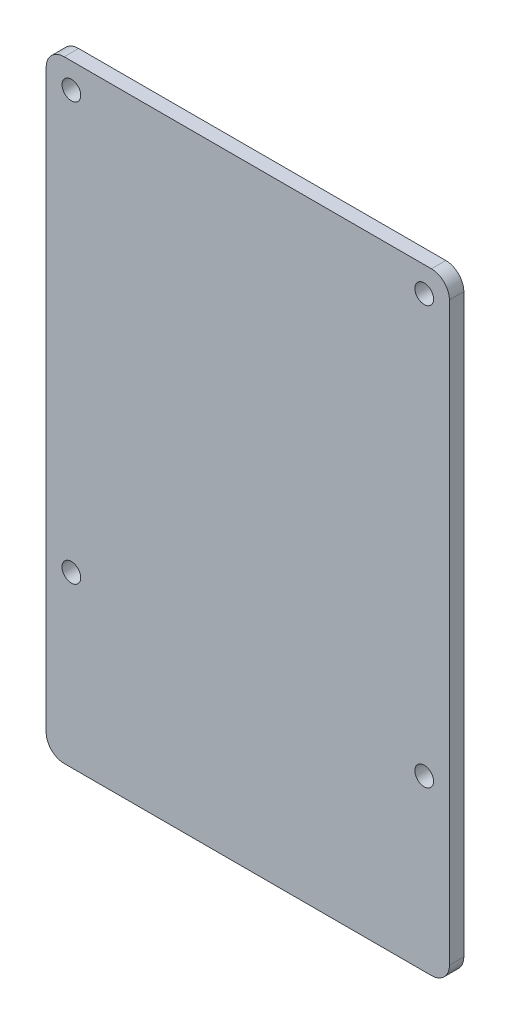
ISO-10303-21;
HEADER;
FILE_DESCRIPTION(('STEP AP214'),'2;1');
FILE_NAME('part.step','',(''),(''),'','','');
FILE_SCHEMA(('AUTOMOTIVE_DESIGN { 1 0 10303 214 1 1 1 1 }'));
ENDSEC;
DATA;
#1=APPLICATION_CONTEXT('core data for automotive mechanical design processes');
#2=APPLICATION_PROTOCOL_DEFINITION('international standard','automotive_design',2000,#1);
#3=PRODUCT_CONTEXT('',#1,'mechanical');
#4=PRODUCT('Part','Part','',(#3));
#5=PRODUCT_RELATED_PRODUCT_CATEGORY('part','',(#4));
#6=PRODUCT_DEFINITION_FORMATION('','',#4);
#7=PRODUCT_DEFINITION_CONTEXT('part definition',#1,'design');
#8=PRODUCT_DEFINITION('design','',#6,#7);
#9=PRODUCT_DEFINITION_SHAPE('','',#8);
#10=(LENGTH_UNIT() NAMED_UNIT(*) SI_UNIT(.MILLI.,.METRE.));
#11=(NAMED_UNIT(*) PLANE_ANGLE_UNIT() SI_UNIT($,.RADIAN.));
#12=(NAMED_UNIT(*) SI_UNIT($,.STERADIAN.) SOLID_ANGLE_UNIT());
#13=UNCERTAINTY_MEASURE_WITH_UNIT(LENGTH_MEASURE(1.E-05),#10,'distance_accuracy_value','');
#14=(GEOMETRIC_REPRESENTATION_CONTEXT(3) GLOBAL_UNCERTAINTY_ASSIGNED_CONTEXT((#13)) GLOBAL_UNIT_ASSIGNED_CONTEXT((#10,
#11,#12)) REPRESENTATION_CONTEXT('',''));
#15=CARTESIAN_POINT('',(0.,0.,0.));
#16=DIRECTION('',(0.,0.,1.));
#17=DIRECTION('',(1.,0.,0.));
#18=AXIS2_PLACEMENT_3D('',#15,#16,#17);
#19=CARTESIAN_POINT('',(-1.00000000002509,-78.9999999999772,2.));
#20=DIRECTION('',(0.,0.,1.));
#21=DIRECTION('',(1.,0.,0.));
#22=AXIS2_PLACEMENT_3D('',#19,#20,#21);
#23=PLANE('',#22);
#24=CARTESIAN_POINT('',(-5.04596364692134E-11,-57.9999999999998,2.));
#25=DIRECTION('',(0.,0.,1.));
#26=DIRECTION('',(-1.,0.,0.));
#27=AXIS2_PLACEMENT_3D('',#24,#25,#26);
#28=CIRCLE('',#27,1.29999999995987);
#29=CARTESIAN_POINT('',(-1.30000000001033,-57.9999999999998,2.));
#30=VERTEX_POINT('',#29);
#31=EDGE_CURVE('E192',#30,#30,#28,.T.);
#32=ORIENTED_EDGE('',*,*,#31,.F.);
#33=EDGE_LOOP('',(#32));
#34=FACE_BOUND('',#33,.T.);
#35=CARTESIAN_POINT('',(49.0000000000003,-57.9999999999997,2.));
#36=DIRECTION('',(0.,0.,1.));
#37=DIRECTION('',(1.,0.,0.));
#38=AXIS2_PLACEMENT_3D('',#35,#36,#37);
#39=CIRCLE('',#38,1.3);
#40=CARTESIAN_POINT('',(50.3000000000003,-57.9999999999997,2.));
#41=VERTEX_POINT('',#40);
#42=EDGE_CURVE('E138',#41,#41,#39,.T.);
#43=ORIENTED_EDGE('',*,*,#42,.F.);
#44=EDGE_LOOP('',(#43));
#45=FACE_BOUND('',#44,.T.);
#46=CARTESIAN_POINT('',(-1.00000000002509,-78.9999999999772,2.));
#47=DIRECTION('',(0.,0.,1.));
#48=DIRECTION('',(1.,0.,0.));
#49=AXIS2_PLACEMENT_3D('',#46,#47,#48);
#50=CIRCLE('',#49,2.5);
#51=CARTESIAN_POINT('',(-3.50000000002509,-78.9999999999772,2.));
#52=VERTEX_POINT('',#51);
#53=CARTESIAN_POINT('',(-1.00000000002509,-81.4999999999772,2.));
#54=VERTEX_POINT('',#53);
#55=EDGE_CURVE('E149',#52,#54,#50,.T.);
#56=ORIENTED_EDGE('',*,*,#55,.T.);
#57=DIRECTION('',(1.,0.,0.));
#58=VECTOR('',#57,1.);
#59=CARTESIAN_POINT('',(-1.00000000002509,-81.4999999999772,2.));
#60=LINE('',#59,#58);
#61=CARTESIAN_POINT('',(49.9999999999749,-81.4999999999772,2.));
#62=VERTEX_POINT('',#61);
#63=EDGE_CURVE('E97',#54,#62,#60,.T.);
#64=ORIENTED_EDGE('',*,*,#63,.T.);
#65=CARTESIAN_POINT('',(49.9999999999749,-78.9999999999772,2.));
#66=DIRECTION('',(0.,0.,1.));
#67=DIRECTION('',(1.,0.,0.));
#68=AXIS2_PLACEMENT_3D('',#65,#66,#67);
#69=CIRCLE('',#68,2.5);
#70=CARTESIAN_POINT('',(52.4999999999749,-78.9999999999772,2.));
#71=VERTEX_POINT('',#70);
#72=EDGE_CURVE('E164',#62,#71,#69,.T.);
#73=ORIENTED_EDGE('',*,*,#72,.T.);
#74=DIRECTION('',(0.,1.,0.));
#75=VECTOR('',#74,1.);
#76=CARTESIAN_POINT('',(52.4999999999749,1.00000000002282,2.));
#77=LINE('',#76,#75);
#78=CARTESIAN_POINT('',(52.4999999999749,1.00000000002282,2.));
#79=VERTEX_POINT('',#78);
#80=EDGE_CURVE('E177',#71,#79,#77,.T.);
#81=ORIENTED_EDGE('',*,*,#80,.T.);
#82=CARTESIAN_POINT('',(49.9999999999749,1.00000000002282,2.));
#83=DIRECTION('',(0.,0.,1.));
#84=DIRECTION('',(-1.,0.,0.));
#85=AXIS2_PLACEMENT_3D('',#82,#83,#84);
#86=CIRCLE('',#85,2.5);
#87=CARTESIAN_POINT('',(49.9999999999749,3.50000000002282,2.));
#88=VERTEX_POINT('',#87);
#89=EDGE_CURVE('E116',#79,#88,#86,.T.);
#90=ORIENTED_EDGE('',*,*,#89,.T.);
#91=DIRECTION('',(-1.,0.,0.));
#92=VECTOR('',#91,1.);
#93=CARTESIAN_POINT('',(-1.0000000000251,3.50000000002281,2.));
#94=LINE('',#93,#92);
#95=CARTESIAN_POINT('',(-1.0000000000251,3.50000000002281,2.));
#96=VERTEX_POINT('',#95);
#97=EDGE_CURVE('E110',#88,#96,#94,.T.);
#98=ORIENTED_EDGE('',*,*,#97,.T.);
#99=CARTESIAN_POINT('',(-1.0000000000251,1.00000000002281,2.));
#100=DIRECTION('',(0.,0.,1.));
#101=DIRECTION('',(1.,0.,0.));
#102=AXIS2_PLACEMENT_3D('',#99,#100,#101);
#103=CIRCLE('',#102,2.5);
#104=CARTESIAN_POINT('',(-3.5000000000251,1.00000000002281,2.));
#105=VERTEX_POINT('',#104);
#106=EDGE_CURVE('E114',#96,#105,#103,.T.);
#107=ORIENTED_EDGE('',*,*,#106,.T.);
#108=DIRECTION('',(0.,-1.,0.));
#109=VECTOR('',#108,1.);
#110=CARTESIAN_POINT('',(-3.5000000000251,1.00000000002281,2.));
#111=LINE('',#110,#109);
#112=EDGE_CURVE('E54',#105,#52,#111,.T.);
#113=ORIENTED_EDGE('',*,*,#112,.T.);
#114=EDGE_LOOP('',(#56,#64,#73,#81,#90,#98,#107,#113));
#115=FACE_BOUND('',#114,.T.);
#116=CARTESIAN_POINT('',(48.9999999999498,3.66304209187263E-11,2.));
#117=DIRECTION('',(0.,0.,1.));
#118=DIRECTION('',(1.,0.,0.));
#119=AXIS2_PLACEMENT_3D('',#116,#117,#118);
#120=CIRCLE('',#119,1.30000000002938);
#121=CARTESIAN_POINT('',(50.2999999999792,3.66304209187263E-11,2.));
#122=VERTEX_POINT('',#121);
#123=EDGE_CURVE('E186',#122,#122,#120,.T.);
#124=ORIENTED_EDGE('',*,*,#123,.F.);
#125=EDGE_LOOP('',(#124));
#126=FACE_BOUND('',#125,.T.);
#127=CARTESIAN_POINT('',(0.,0.,2.));
#128=DIRECTION('',(0.,0.,1.));
#129=DIRECTION('',(-1.,0.,0.));
#130=AXIS2_PLACEMENT_3D('',#127,#128,#129);
#131=CIRCLE('',#130,1.29999999999994);
#132=CARTESIAN_POINT('',(-1.29999999999994,0.,2.));
#133=VERTEX_POINT('',#132);
#134=EDGE_CURVE('E198',#133,#133,#131,.T.);
#135=ORIENTED_EDGE('',*,*,#134,.F.);
#136=EDGE_LOOP('',(#135));
#137=FACE_BOUND('',#136,.T.);
#138=ADVANCED_FACE('F37',(#34,#45,#115,#126,#137),#23,.T.);
#139=CARTESIAN_POINT('',(-1.00000000002509,-78.9999999999772,0.));
#140=DIRECTION('',(0.,0.,1.));
#141=DIRECTION('',(1.,0.,0.));
#142=AXIS2_PLACEMENT_3D('',#139,#140,#141);
#143=PLANE('',#142);
#144=CARTESIAN_POINT('',(-1.00000000002509,-78.9999999999772,0.));
#145=DIRECTION('',(0.,0.,1.));
#146=DIRECTION('',(1.,0.,0.));
#147=AXIS2_PLACEMENT_3D('',#144,#145,#146);
#148=CIRCLE('',#147,2.5);
#149=CARTESIAN_POINT('',(-3.50000000002509,-78.9999999999772,0.));
#150=VERTEX_POINT('',#149);
#151=CARTESIAN_POINT('',(-1.00000000002509,-81.4999999999772,0.));
#152=VERTEX_POINT('',#151);
#153=EDGE_CURVE('E134',#150,#152,#148,.T.);
#154=ORIENTED_EDGE('',*,*,#153,.F.);
#155=DIRECTION('',(0.,-1.,0.));
#156=VECTOR('',#155,1.);
#157=CARTESIAN_POINT('',(-3.5000000000251,1.00000000002281,0.));
#158=LINE('',#157,#156);
#159=CARTESIAN_POINT('',(-3.5000000000251,1.00000000002281,0.));
#160=VERTEX_POINT('',#159);
#161=EDGE_CURVE('E89',#160,#150,#158,.T.);
#162=ORIENTED_EDGE('',*,*,#161,.F.);
#163=CARTESIAN_POINT('',(-1.0000000000251,1.00000000002281,0.));
#164=DIRECTION('',(0.,0.,1.));
#165=DIRECTION('',(1.,0.,0.));
#166=AXIS2_PLACEMENT_3D('',#163,#164,#165);
#167=CIRCLE('',#166,2.5);
#168=CARTESIAN_POINT('',(-1.0000000000251,3.50000000002281,0.));
#169=VERTEX_POINT('',#168);
#170=EDGE_CURVE('E83',#169,#160,#167,.T.);
#171=ORIENTED_EDGE('',*,*,#170,.F.);
#172=DIRECTION('',(-1.,0.,0.));
#173=VECTOR('',#172,1.);
#174=CARTESIAN_POINT('',(-1.0000000000251,3.50000000002281,0.));
#175=LINE('',#174,#173);
#176=CARTESIAN_POINT('',(49.9999999999749,3.50000000002282,0.));
#177=VERTEX_POINT('',#176);
#178=EDGE_CURVE('E124',#177,#169,#175,.T.);
#179=ORIENTED_EDGE('',*,*,#178,.F.);
#180=CARTESIAN_POINT('',(49.9999999999749,1.00000000002282,0.));
#181=DIRECTION('',(0.,0.,1.));
#182=DIRECTION('',(-1.,0.,0.));
#183=AXIS2_PLACEMENT_3D('',#180,#181,#182);
#184=CIRCLE('',#183,2.5);
#185=CARTESIAN_POINT('',(52.4999999999749,1.00000000002282,0.));
#186=VERTEX_POINT('',#185);
#187=EDGE_CURVE('E144',#186,#177,#184,.T.);
#188=ORIENTED_EDGE('',*,*,#187,.F.);
#189=DIRECTION('',(0.,1.,0.));
#190=VECTOR('',#189,1.);
#191=CARTESIAN_POINT('',(52.4999999999749,1.00000000002282,0.));
#192=LINE('',#191,#190);
#193=CARTESIAN_POINT('',(52.4999999999749,-78.9999999999772,0.));
#194=VERTEX_POINT('',#193);
#195=EDGE_CURVE('E142',#194,#186,#192,.T.);
#196=ORIENTED_EDGE('',*,*,#195,.F.);
#197=CARTESIAN_POINT('',(49.9999999999749,-78.9999999999772,0.));
#198=DIRECTION('',(0.,0.,1.));
#199=DIRECTION('',(1.,0.,0.));
#200=AXIS2_PLACEMENT_3D('',#197,#198,#199);
#201=CIRCLE('',#200,2.5);
#202=CARTESIAN_POINT('',(49.9999999999749,-81.4999999999772,0.));
#203=VERTEX_POINT('',#202);
#204=EDGE_CURVE('E140',#203,#194,#201,.T.);
#205=ORIENTED_EDGE('',*,*,#204,.F.);
#206=DIRECTION('',(1.,0.,0.));
#207=VECTOR('',#206,1.);
#208=CARTESIAN_POINT('',(-1.00000000002509,-81.4999999999772,0.));
#209=LINE('',#208,#207);
#210=EDGE_CURVE('E137',#152,#203,#209,.T.);
#211=ORIENTED_EDGE('',*,*,#210,.F.);
#212=EDGE_LOOP('',(#154,#162,#171,#179,#188,#196,#205,#211));
#213=FACE_BOUND('',#212,.T.);
#214=CARTESIAN_POINT('',(49.0000000000003,-57.9999999999997,0.));
#215=DIRECTION('',(0.,0.,1.));
#216=DIRECTION('',(1.,0.,0.));
#217=AXIS2_PLACEMENT_3D('',#214,#215,#216);
#218=CIRCLE('',#217,1.3);
#219=CARTESIAN_POINT('',(50.3000000000003,-57.9999999999997,0.));
#220=VERTEX_POINT('',#219);
#221=EDGE_CURVE('E183',#220,#220,#218,.T.);
#222=ORIENTED_EDGE('',*,*,#221,.T.);
#223=EDGE_LOOP('',(#222));
#224=FACE_BOUND('',#223,.T.);
#225=CARTESIAN_POINT('',(48.9999999999498,3.66304209187263E-11,0.));
#226=DIRECTION('',(0.,0.,1.));
#227=DIRECTION('',(1.,0.,0.));
#228=AXIS2_PLACEMENT_3D('',#225,#226,#227);
#229=CIRCLE('',#228,1.30000000002938);
#230=CARTESIAN_POINT('',(50.2999999999792,3.66304209187263E-11,0.));
#231=VERTEX_POINT('',#230);
#232=EDGE_CURVE('E189',#231,#231,#229,.T.);
#233=ORIENTED_EDGE('',*,*,#232,.T.);
#234=EDGE_LOOP('',(#233));
#235=FACE_BOUND('',#234,.T.);
#236=CARTESIAN_POINT('',(-5.04596364692134E-11,-57.9999999999998,0.));
#237=DIRECTION('',(0.,0.,1.));
#238=DIRECTION('',(-1.,0.,0.));
#239=AXIS2_PLACEMENT_3D('',#236,#237,#238);
#240=CIRCLE('',#239,1.29999999995987);
#241=CARTESIAN_POINT('',(-1.30000000001033,-57.9999999999998,0.));
#242=VERTEX_POINT('',#241);
#243=EDGE_CURVE('E195',#242,#242,#240,.T.);
#244=ORIENTED_EDGE('',*,*,#243,.T.);
#245=EDGE_LOOP('',(#244));
#246=FACE_BOUND('',#245,.T.);
#247=CARTESIAN_POINT('',(0.,0.,0.));
#248=DIRECTION('',(0.,0.,1.));
#249=DIRECTION('',(-1.,0.,0.));
#250=AXIS2_PLACEMENT_3D('',#247,#248,#249);
#251=CIRCLE('',#250,1.29999999999994);
#252=CARTESIAN_POINT('',(-1.29999999999994,0.,0.));
#253=VERTEX_POINT('',#252);
#254=EDGE_CURVE('E201',#253,#253,#251,.T.);
#255=ORIENTED_EDGE('',*,*,#254,.T.);
#256=EDGE_LOOP('',(#255));
#257=FACE_BOUND('',#256,.T.);
#258=ADVANCED_FACE('F168',(#213,#224,#235,#246,#257),#143,.F.);
#259=CARTESIAN_POINT('',(-1.00000000002509,-78.9999999999772,2.));
#260=DIRECTION('',(0.,0.,-1.));
#261=DIRECTION('',(-1.,0.,0.));
#262=AXIS2_PLACEMENT_3D('',#259,#260,#261);
#263=CYLINDRICAL_SURFACE('',#262,2.5);
#264=ORIENTED_EDGE('',*,*,#153,.T.);
#265=DIRECTION('',(0.,0.,-1.));
#266=VECTOR('',#265,1.);
#267=CARTESIAN_POINT('',(-1.00000000002509,-81.4999999999772,2.));
#268=LINE('',#267,#266);
#269=EDGE_CURVE('E11',#54,#152,#268,.T.);
#270=ORIENTED_EDGE('',*,*,#269,.F.);
#271=ORIENTED_EDGE('',*,*,#55,.F.);
#272=DIRECTION('',(0.,0.,-1.));
#273=VECTOR('',#272,1.);
#274=CARTESIAN_POINT('',(-3.50000000002509,-78.9999999999772,2.));
#275=LINE('',#274,#273);
#276=EDGE_CURVE('E130',#52,#150,#275,.T.);
#277=ORIENTED_EDGE('',*,*,#276,.T.);
#278=EDGE_LOOP('',(#264,#270,#271,#277));
#279=FACE_BOUND('',#278,.T.);
#280=ADVANCED_FACE('F39',(#279),#263,.T.);
#281=CARTESIAN_POINT('',(-1.00000000002509,-81.4999999999772,2.));
#282=DIRECTION('',(0.,1.,0.));
#283=DIRECTION('',(0.,0.,1.));
#284=AXIS2_PLACEMENT_3D('',#281,#282,#283);
#285=PLANE('',#284);
#286=ORIENTED_EDGE('',*,*,#210,.T.);
#287=DIRECTION('',(0.,0.,-1.));
#288=VECTOR('',#287,1.);
#289=CARTESIAN_POINT('',(49.9999999999749,-81.4999999999772,2.));
#290=LINE('',#289,#288);
#291=EDGE_CURVE('E46',#62,#203,#290,.T.);
#292=ORIENTED_EDGE('',*,*,#291,.F.);
#293=ORIENTED_EDGE('',*,*,#63,.F.);
#294=ORIENTED_EDGE('',*,*,#269,.T.);
#295=EDGE_LOOP('',(#286,#292,#293,#294));
#296=FACE_BOUND('',#295,.T.);
#297=ADVANCED_FACE('F235',(#296),#285,.F.);
#298=CARTESIAN_POINT('',(49.9999999999749,-78.9999999999772,2.));
#299=DIRECTION('',(0.,0.,-1.));
#300=DIRECTION('',(-1.,0.,0.));
#301=AXIS2_PLACEMENT_3D('',#298,#299,#300);
#302=CYLINDRICAL_SURFACE('',#301,2.5);
#303=ORIENTED_EDGE('',*,*,#204,.T.);
#304=DIRECTION('',(0.,0.,-1.));
#305=VECTOR('',#304,1.);
#306=CARTESIAN_POINT('',(52.4999999999749,-78.9999999999772,2.));
#307=LINE('',#306,#305);
#308=EDGE_CURVE('E156',#71,#194,#307,.T.);
#309=ORIENTED_EDGE('',*,*,#308,.F.);
#310=ORIENTED_EDGE('',*,*,#72,.F.);
#311=ORIENTED_EDGE('',*,*,#291,.T.);
#312=EDGE_LOOP('',(#303,#309,#310,#311));
#313=FACE_BOUND('',#312,.T.);
#314=ADVANCED_FACE('F162',(#313),#302,.T.);
#315=CARTESIAN_POINT('',(52.4999999999749,1.00000000002282,2.));
#316=DIRECTION('',(-1.,0.,0.));
#317=DIRECTION('',(0.,-1.,0.));
#318=AXIS2_PLACEMENT_3D('',#315,#316,#317);
#319=PLANE('',#318);
#320=ORIENTED_EDGE('',*,*,#195,.T.);
#321=DIRECTION('',(0.,0.,-1.));
#322=VECTOR('',#321,1.);
#323=CARTESIAN_POINT('',(52.4999999999749,1.00000000002282,2.));
#324=LINE('',#323,#322);
#325=EDGE_CURVE('E153',#79,#186,#324,.T.);
#326=ORIENTED_EDGE('',*,*,#325,.F.);
#327=ORIENTED_EDGE('',*,*,#80,.F.);
#328=ORIENTED_EDGE('',*,*,#308,.T.);
#329=EDGE_LOOP('',(#320,#326,#327,#328));
#330=FACE_BOUND('',#329,.T.);
#331=ADVANCED_FACE('F173',(#330),#319,.F.);
#332=CARTESIAN_POINT('',(49.9999999999749,1.00000000002282,2.));
#333=DIRECTION('',(0.,0.,-1.));
#334=DIRECTION('',(-1.,0.,0.));
#335=AXIS2_PLACEMENT_3D('',#332,#333,#334);
#336=CYLINDRICAL_SURFACE('',#335,2.5);
#337=ORIENTED_EDGE('',*,*,#187,.T.);
#338=DIRECTION('',(0.,0.,-1.));
#339=VECTOR('',#338,1.);
#340=CARTESIAN_POINT('',(49.9999999999749,3.50000000002282,2.));
#341=LINE('',#340,#339);
#342=EDGE_CURVE('E125',#88,#177,#341,.T.);
#343=ORIENTED_EDGE('',*,*,#342,.F.);
#344=ORIENTED_EDGE('',*,*,#89,.F.);
#345=ORIENTED_EDGE('',*,*,#325,.T.);
#346=EDGE_LOOP('',(#337,#343,#344,#345));
#347=FACE_BOUND('',#346,.T.);
#348=ADVANCED_FACE('F176',(#347),#336,.T.);
#349=CARTESIAN_POINT('',(-1.0000000000251,3.50000000002281,2.));
#350=DIRECTION('',(0.,-1.,0.));
#351=DIRECTION('',(1.,0.,0.));
#352=AXIS2_PLACEMENT_3D('',#349,#350,#351);
#353=PLANE('',#352);
#354=ORIENTED_EDGE('',*,*,#178,.T.);
#355=DIRECTION('',(0.,0.,-1.));
#356=VECTOR('',#355,1.);
#357=CARTESIAN_POINT('',(-1.0000000000251,3.50000000002281,2.));
#358=LINE('',#357,#356);
#359=EDGE_CURVE('E121',#96,#169,#358,.T.);
#360=ORIENTED_EDGE('',*,*,#359,.F.);
#361=ORIENTED_EDGE('',*,*,#97,.F.);
#362=ORIENTED_EDGE('',*,*,#342,.T.);
#363=EDGE_LOOP('',(#354,#360,#361,#362));
#364=FACE_BOUND('',#363,.T.);
#365=ADVANCED_FACE('F122',(#364),#353,.F.);
#366=CARTESIAN_POINT('',(-1.0000000000251,1.00000000002281,2.));
#367=DIRECTION('',(0.,0.,-1.));
#368=DIRECTION('',(-1.,0.,0.));
#369=AXIS2_PLACEMENT_3D('',#366,#367,#368);
#370=CYLINDRICAL_SURFACE('',#369,2.5);
#371=ORIENTED_EDGE('',*,*,#170,.T.);
#372=DIRECTION('',(0.,0.,-1.));
#373=VECTOR('',#372,1.);
#374=CARTESIAN_POINT('',(-3.5000000000251,1.00000000002281,2.));
#375=LINE('',#374,#373);
#376=EDGE_CURVE('E126',#105,#160,#375,.T.);
#377=ORIENTED_EDGE('',*,*,#376,.F.);
#378=ORIENTED_EDGE('',*,*,#106,.F.);
#379=ORIENTED_EDGE('',*,*,#359,.T.);
#380=EDGE_LOOP('',(#371,#377,#378,#379));
#381=FACE_BOUND('',#380,.T.);
#382=ADVANCED_FACE('F128',(#381),#370,.T.);
#383=CARTESIAN_POINT('',(-3.5000000000251,1.00000000002281,2.));
#384=DIRECTION('',(1.,0.,0.));
#385=DIRECTION('',(0.,1.,0.));
#386=AXIS2_PLACEMENT_3D('',#383,#384,#385);
#387=PLANE('',#386);
#388=ORIENTED_EDGE('',*,*,#161,.T.);
#389=ORIENTED_EDGE('',*,*,#276,.F.);
#390=ORIENTED_EDGE('',*,*,#112,.F.);
#391=ORIENTED_EDGE('',*,*,#376,.T.);
#392=EDGE_LOOP('',(#388,#389,#390,#391));
#393=FACE_BOUND('',#392,.T.);
#394=ADVANCED_FACE('F223',(#393),#387,.F.);
#395=CARTESIAN_POINT('',(49.0000000000003,-57.9999999999997,2.));
#396=DIRECTION('',(0.,0.,-1.));
#397=DIRECTION('',(-1.,0.,0.));
#398=AXIS2_PLACEMENT_3D('',#395,#396,#397);
#399=CYLINDRICAL_SURFACE('',#398,1.3);
#400=ORIENTED_EDGE('',*,*,#42,.T.);
#401=EDGE_LOOP('',(#400));
#402=FACE_BOUND('',#401,.T.);
#403=ORIENTED_EDGE('',*,*,#221,.F.);
#404=EDGE_LOOP('',(#403));
#405=FACE_BOUND('',#404,.T.);
#406=ADVANCED_FACE('F220',(#402,#405),#399,.F.);
#407=CARTESIAN_POINT('',(48.9999999999498,3.66304209187263E-11,2.));
#408=DIRECTION('',(0.,0.,-1.));
#409=DIRECTION('',(-1.,0.,0.));
#410=AXIS2_PLACEMENT_3D('',#407,#408,#409);
#411=CYLINDRICAL_SURFACE('',#410,1.30000000002938);
#412=ORIENTED_EDGE('',*,*,#123,.T.);
#413=EDGE_LOOP('',(#412));
#414=FACE_BOUND('',#413,.T.);
#415=ORIENTED_EDGE('',*,*,#232,.F.);
#416=EDGE_LOOP('',(#415));
#417=FACE_BOUND('',#416,.T.);
#418=ADVANCED_FACE('F299',(#414,#417),#411,.F.);
#419=CARTESIAN_POINT('',(-5.04596364692134E-11,-57.9999999999998,2.));
#420=DIRECTION('',(0.,0.,-1.));
#421=DIRECTION('',(-1.,0.,0.));
#422=AXIS2_PLACEMENT_3D('',#419,#420,#421);
#423=CYLINDRICAL_SURFACE('',#422,1.29999999995987);
#424=ORIENTED_EDGE('',*,*,#31,.T.);
#425=EDGE_LOOP('',(#424));
#426=FACE_BOUND('',#425,.T.);
#427=ORIENTED_EDGE('',*,*,#243,.F.);
#428=EDGE_LOOP('',(#427));
#429=FACE_BOUND('',#428,.T.);
#430=ADVANCED_FACE('F307',(#426,#429),#423,.F.);
#431=CARTESIAN_POINT('',(0.,0.,2.));
#432=DIRECTION('',(0.,0.,-1.));
#433=DIRECTION('',(-1.,0.,0.));
#434=AXIS2_PLACEMENT_3D('',#431,#432,#433);
#435=CYLINDRICAL_SURFACE('',#434,1.29999999999994);
#436=ORIENTED_EDGE('',*,*,#134,.T.);
#437=EDGE_LOOP('',(#436));
#438=FACE_BOUND('',#437,.T.);
#439=ORIENTED_EDGE('',*,*,#254,.F.);
#440=EDGE_LOOP('',(#439));
#441=FACE_BOUND('',#440,.T.);
#442=ADVANCED_FACE('F207',(#438,#441),#435,.F.);
#443=CLOSED_SHELL('',(#138,#258,#280,#297,#314,#331,#348,#365,#382,#394,#406,#418,#430,#442));
#444=MANIFOLD_SOLID_BREP('B2',#443);
#445=ADVANCED_BREP_SHAPE_REPRESENTATION('',(#18,#444),#14);
#446=SHAPE_DEFINITION_REPRESENTATION(#9,#445);
ENDSEC;
END-ISO-10303-21;
